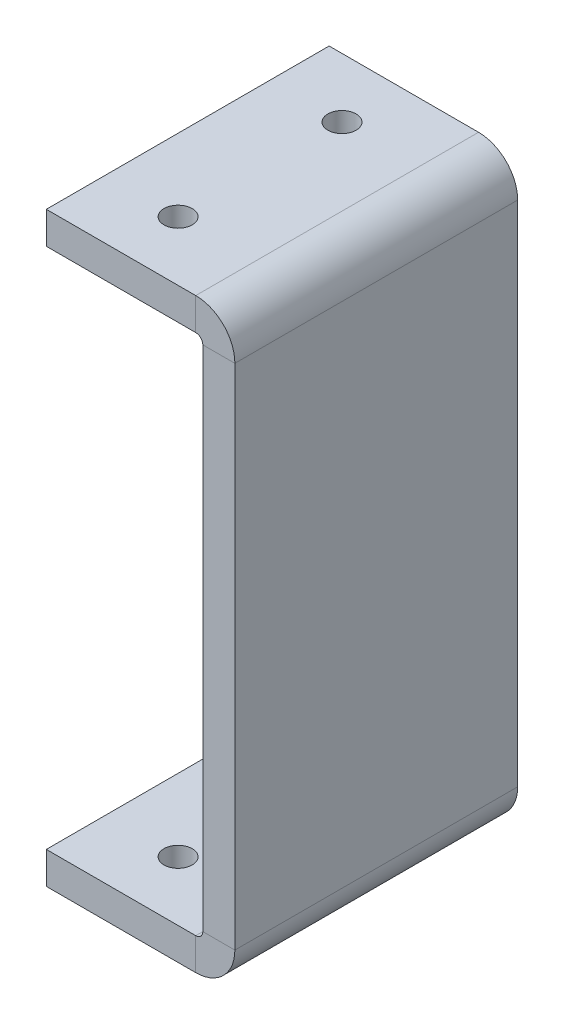
ISO-10303-21;
HEADER;
FILE_DESCRIPTION(('STEP AP214'),'2;1');
FILE_NAME('part.step','',(''),(''),'','','');
FILE_SCHEMA(('AUTOMOTIVE_DESIGN { 1 0 10303 214 1 1 1 1 }'));
ENDSEC;
DATA;
#1=APPLICATION_CONTEXT('core data for automotive mechanical design processes');
#2=APPLICATION_PROTOCOL_DEFINITION('international standard','automotive_design',2000,#1);
#3=PRODUCT_CONTEXT('',#1,'mechanical');
#4=PRODUCT('Part','Part','',(#3));
#5=PRODUCT_RELATED_PRODUCT_CATEGORY('part','',(#4));
#6=PRODUCT_DEFINITION_FORMATION('','',#4);
#7=PRODUCT_DEFINITION_CONTEXT('part definition',#1,'design');
#8=PRODUCT_DEFINITION('design','',#6,#7);
#9=PRODUCT_DEFINITION_SHAPE('','',#8);
#10=(LENGTH_UNIT() NAMED_UNIT(*) SI_UNIT(.MILLI.,.METRE.));
#11=(NAMED_UNIT(*) PLANE_ANGLE_UNIT() SI_UNIT($,.RADIAN.));
#12=(NAMED_UNIT(*) SI_UNIT($,.STERADIAN.) SOLID_ANGLE_UNIT());
#13=UNCERTAINTY_MEASURE_WITH_UNIT(LENGTH_MEASURE(1.E-05),#10,'distance_accuracy_value','');
#14=(GEOMETRIC_REPRESENTATION_CONTEXT(3) GLOBAL_UNCERTAINTY_ASSIGNED_CONTEXT((#13)) GLOBAL_UNIT_ASSIGNED_CONTEXT((#10,
#11,#12)) REPRESENTATION_CONTEXT('',''));
#15=CARTESIAN_POINT('',(0.,0.,0.));
#16=DIRECTION('',(0.,0.,1.));
#17=DIRECTION('',(1.,0.,0.));
#18=AXIS2_PLACEMENT_3D('',#15,#16,#17);
#19=CARTESIAN_POINT('',(1.093708560151E-13,31.1,0.));
#20=DIRECTION('',(0.,-1.,0.));
#21=DIRECTION('',(1.,0.,0.));
#22=AXIS2_PLACEMENT_3D('',#19,#20,#21);
#23=PLANE('',#22);
#24=DIRECTION('',(0.,0.,-1.));
#25=VECTOR('',#24,1.);
#26=CARTESIAN_POINT('',(-4.15,31.1,30.));
#27=LINE('',#26,#25);
#28=CARTESIAN_POINT('',(-4.15,31.1,0.));
#29=VERTEX_POINT('',#28);
#30=CARTESIAN_POINT('',(-4.15,31.1,30.));
#31=VERTEX_POINT('',#30);
#32=EDGE_CURVE('E265',#29,#31,#27,.F.);
#33=ORIENTED_EDGE('',*,*,#32,.F.);
#34=DIRECTION('',(-1.,0.,0.));
#35=VECTOR('',#34,1.);
#36=CARTESIAN_POINT('',(1.093708560151E-13,31.1,0.));
#37=LINE('',#36,#35);
#38=CARTESIAN_POINT('',(-20.,31.1000000000001,0.));
#39=VERTEX_POINT('',#38);
#40=EDGE_CURVE('E253',#29,#39,#37,.T.);
#41=ORIENTED_EDGE('',*,*,#40,.T.);
#42=DIRECTION('',(0.,0.,1.));
#43=VECTOR('',#42,1.);
#44=CARTESIAN_POINT('',(-20.,31.1000000000001,0.));
#45=LINE('',#44,#43);
#46=CARTESIAN_POINT('',(-20.,31.1000000000001,30.));
#47=VERTEX_POINT('',#46);
#48=EDGE_CURVE('E251',#39,#47,#45,.T.);
#49=ORIENTED_EDGE('',*,*,#48,.T.);
#50=DIRECTION('',(1.,0.,0.));
#51=VECTOR('',#50,1.);
#52=CARTESIAN_POINT('',(1.093708560151E-13,31.1,30.));
#53=LINE('',#52,#51);
#54=EDGE_CURVE('E255',#47,#31,#53,.T.);
#55=ORIENTED_EDGE('',*,*,#54,.T.);
#56=EDGE_LOOP('',(#33,#41,#49,#55));
#57=FACE_BOUND('',#56,.T.);
#58=CARTESIAN_POINT('',(-12.3293714059226,31.1,6.30666756339837));
#59=DIRECTION('',(0.,1.,0.));
#60=DIRECTION('',(-1.,0.,0.));
#61=AXIS2_PLACEMENT_3D('',#58,#59,#60);
#62=CIRCLE('',#61,1.5);
#63=CARTESIAN_POINT('',(-13.8293714059226,31.1,6.30666756339837));
#64=VERTEX_POINT('',#63);
#65=EDGE_CURVE('E319',#64,#64,#62,.F.);
#66=ORIENTED_EDGE('',*,*,#65,.T.);
#67=EDGE_LOOP('',(#66));
#68=FACE_BOUND('',#67,.T.);
#69=CARTESIAN_POINT('',(-12.3293714059226,31.1,23.6933324366016));
#70=DIRECTION('',(0.,1.,0.));
#71=DIRECTION('',(-1.,0.,0.));
#72=AXIS2_PLACEMENT_3D('',#69,#70,#71);
#73=CIRCLE('',#72,1.49999999999998);
#74=CARTESIAN_POINT('',(-13.8293714059226,31.1,23.6933324366016));
#75=VERTEX_POINT('',#74);
#76=EDGE_CURVE('E309',#75,#75,#73,.T.);
#77=ORIENTED_EDGE('',*,*,#76,.F.);
#78=EDGE_LOOP('',(#77));
#79=FACE_BOUND('',#78,.T.);
#80=ADVANCED_FACE('F88',(#57,#68,#79),#23,.F.);
#81=CARTESIAN_POINT('',(0.,27.7,0.));
#82=DIRECTION('',(0.,-1.,0.));
#83=DIRECTION('',(1.,0.,0.));
#84=AXIS2_PLACEMENT_3D('',#81,#82,#83);
#85=PLANE('',#84);
#86=CARTESIAN_POINT('',(-12.3293714059226,27.7,6.30666756339837));
#87=DIRECTION('',(0.,-1.,0.));
#88=DIRECTION('',(1.,0.,0.));
#89=AXIS2_PLACEMENT_3D('',#86,#87,#88);
#90=CIRCLE('',#89,1.5);
#91=CARTESIAN_POINT('',(-10.8293714059226,27.7,6.30666756339837));
#92=VERTEX_POINT('',#91);
#93=EDGE_CURVE('E302',#92,#92,#90,.F.);
#94=ORIENTED_EDGE('',*,*,#93,.T.);
#95=EDGE_LOOP('',(#94));
#96=FACE_BOUND('',#95,.T.);
#97=DIRECTION('',(1.,0.,0.));
#98=VECTOR('',#97,1.);
#99=CARTESIAN_POINT('',(-20.,27.7000000000001,0.));
#100=LINE('',#99,#98);
#101=CARTESIAN_POINT('',(-4.15000000000001,27.7,0.));
#102=VERTEX_POINT('',#101);
#103=CARTESIAN_POINT('',(-20.,27.7000000000001,0.));
#104=VERTEX_POINT('',#103);
#105=EDGE_CURVE('E260',#102,#104,#100,.F.);
#106=ORIENTED_EDGE('',*,*,#105,.F.);
#107=DIRECTION('',(0.,0.,-1.));
#108=VECTOR('',#107,1.);
#109=CARTESIAN_POINT('',(-4.15000000000001,27.7,30.));
#110=LINE('',#109,#108);
#111=CARTESIAN_POINT('',(-4.15000000000001,27.7,30.));
#112=VERTEX_POINT('',#111);
#113=EDGE_CURVE('E270',#112,#102,#110,.T.);
#114=ORIENTED_EDGE('',*,*,#113,.F.);
#115=DIRECTION('',(-1.,0.,0.));
#116=VECTOR('',#115,1.);
#117=CARTESIAN_POINT('',(-3.40000000000001,27.7,30.));
#118=LINE('',#117,#116);
#119=CARTESIAN_POINT('',(-20.,27.7000000000001,30.));
#120=VERTEX_POINT('',#119);
#121=EDGE_CURVE('E262',#120,#112,#118,.F.);
#122=ORIENTED_EDGE('',*,*,#121,.F.);
#123=DIRECTION('',(0.,0.,-1.));
#124=VECTOR('',#123,1.);
#125=CARTESIAN_POINT('',(-20.,27.7000000000001,30.));
#126=LINE('',#125,#124);
#127=EDGE_CURVE('E258',#104,#120,#126,.F.);
#128=ORIENTED_EDGE('',*,*,#127,.F.);
#129=EDGE_LOOP('',(#106,#114,#122,#128));
#130=FACE_BOUND('',#129,.T.);
#131=CARTESIAN_POINT('',(-12.3293714059226,27.7,23.6933324366016));
#132=DIRECTION('',(0.,-1.,0.));
#133=DIRECTION('',(1.,0.,0.));
#134=AXIS2_PLACEMENT_3D('',#131,#132,#133);
#135=CIRCLE('',#134,1.49999999999998);
#136=CARTESIAN_POINT('',(-10.8293714059227,27.7,23.6933324366016));
#137=VERTEX_POINT('',#136);
#138=EDGE_CURVE('E222',#137,#137,#135,.T.);
#139=ORIENTED_EDGE('',*,*,#138,.F.);
#140=EDGE_LOOP('',(#139));
#141=FACE_BOUND('',#140,.T.);
#142=ADVANCED_FACE('F379',(#96,#130,#141),#85,.T.);
#143=CARTESIAN_POINT('',(1.28870819907707E-13,-31.1,0.));
#144=DIRECTION('',(0.,1.,0.));
#145=DIRECTION('',(-1.,0.,0.));
#146=AXIS2_PLACEMENT_3D('',#143,#144,#145);
#147=PLANE('',#146);
#148=DIRECTION('',(0.,0.,1.));
#149=VECTOR('',#148,1.);
#150=CARTESIAN_POINT('',(-4.14999999999997,-31.1,0.));
#151=LINE('',#150,#149);
#152=CARTESIAN_POINT('',(-4.14999999999997,-31.1,30.));
#153=VERTEX_POINT('',#152);
#154=CARTESIAN_POINT('',(-4.14999999999997,-31.1,0.));
#155=VERTEX_POINT('',#154);
#156=EDGE_CURVE('E214',#153,#155,#151,.F.);
#157=ORIENTED_EDGE('',*,*,#156,.F.);
#158=DIRECTION('',(-1.,0.,0.));
#159=VECTOR('',#158,1.);
#160=CARTESIAN_POINT('',(1.28870819907707E-13,-31.1,30.));
#161=LINE('',#160,#159);
#162=CARTESIAN_POINT('',(-20.,-31.1000000000001,30.));
#163=VERTEX_POINT('',#162);
#164=EDGE_CURVE('E187',#153,#163,#161,.T.);
#165=ORIENTED_EDGE('',*,*,#164,.T.);
#166=DIRECTION('',(0.,0.,-1.));
#167=VECTOR('',#166,1.);
#168=CARTESIAN_POINT('',(-20.,-31.1000000000001,0.));
#169=LINE('',#168,#167);
#170=CARTESIAN_POINT('',(-20.,-31.1000000000001,0.));
#171=VERTEX_POINT('',#170);
#172=EDGE_CURVE('E179',#163,#171,#169,.T.);
#173=ORIENTED_EDGE('',*,*,#172,.T.);
#174=DIRECTION('',(1.,0.,0.));
#175=VECTOR('',#174,1.);
#176=CARTESIAN_POINT('',(1.28870819907707E-13,-31.1,0.));
#177=LINE('',#176,#175);
#178=EDGE_CURVE('E185',#171,#155,#177,.T.);
#179=ORIENTED_EDGE('',*,*,#178,.T.);
#180=EDGE_LOOP('',(#157,#165,#173,#179));
#181=FACE_BOUND('',#180,.T.);
#182=CARTESIAN_POINT('',(-12.3293714059228,-31.1000000000001,6.30666756339837));
#183=DIRECTION('',(0.,1.,0.));
#184=DIRECTION('',(-1.,0.,0.));
#185=AXIS2_PLACEMENT_3D('',#182,#183,#184);
#186=CIRCLE('',#185,1.5);
#187=CARTESIAN_POINT('',(-13.8293714059228,-31.1000000000001,6.30666756339837));
#188=VERTEX_POINT('',#187);
#189=EDGE_CURVE('E314',#188,#188,#186,.F.);
#190=ORIENTED_EDGE('',*,*,#189,.F.);
#191=EDGE_LOOP('',(#190));
#192=FACE_BOUND('',#191,.T.);
#193=CARTESIAN_POINT('',(-12.3293714059228,-31.1000000000001,23.6933324366016));
#194=DIRECTION('',(0.,1.,0.));
#195=DIRECTION('',(-1.,0.,0.));
#196=AXIS2_PLACEMENT_3D('',#193,#194,#195);
#197=CIRCLE('',#196,1.49999999999998);
#198=CARTESIAN_POINT('',(-13.8293714059228,-31.1000000000001,23.6933324366016));
#199=VERTEX_POINT('',#198);
#200=EDGE_CURVE('E303',#199,#199,#197,.T.);
#201=ORIENTED_EDGE('',*,*,#200,.T.);
#202=EDGE_LOOP('',(#201));
#203=FACE_BOUND('',#202,.T.);
#204=ADVANCED_FACE('F182',(#181,#192,#203),#147,.F.);
#205=CARTESIAN_POINT('',(1.15958833576365E-13,-27.7,0.));
#206=DIRECTION('',(0.,1.,0.));
#207=DIRECTION('',(-1.,0.,0.));
#208=AXIS2_PLACEMENT_3D('',#205,#206,#207);
#209=PLANE('',#208);
#210=CARTESIAN_POINT('',(-12.3293714059228,-27.7,6.30666756339837));
#211=DIRECTION('',(0.,1.,0.));
#212=DIRECTION('',(-1.,0.,0.));
#213=AXIS2_PLACEMENT_3D('',#210,#211,#212);
#214=CIRCLE('',#213,1.5);
#215=CARTESIAN_POINT('',(-13.8293714059228,-27.7,6.30666756339837));
#216=VERTEX_POINT('',#215);
#217=EDGE_CURVE('E300',#216,#216,#214,.F.);
#218=ORIENTED_EDGE('',*,*,#217,.T.);
#219=EDGE_LOOP('',(#218));
#220=FACE_BOUND('',#219,.T.);
#221=DIRECTION('',(1.,0.,0.));
#222=VECTOR('',#221,1.);
#223=CARTESIAN_POINT('',(-20.,-27.7000000000001,30.));
#224=LINE('',#223,#222);
#225=CARTESIAN_POINT('',(-4.14999999999999,-27.7,30.));
#226=VERTEX_POINT('',#225);
#227=CARTESIAN_POINT('',(-20.,-27.7000000000001,30.));
#228=VERTEX_POINT('',#227);
#229=EDGE_CURVE('E212',#226,#228,#224,.F.);
#230=ORIENTED_EDGE('',*,*,#229,.F.);
#231=DIRECTION('',(0.,0.,1.));
#232=VECTOR('',#231,1.);
#233=CARTESIAN_POINT('',(-4.14999999999999,-27.7,0.));
#234=LINE('',#233,#232);
#235=CARTESIAN_POINT('',(-4.14999999999999,-27.7,0.));
#236=VERTEX_POINT('',#235);
#237=EDGE_CURVE('E219',#236,#226,#234,.T.);
#238=ORIENTED_EDGE('',*,*,#237,.F.);
#239=DIRECTION('',(-1.,0.,0.));
#240=VECTOR('',#239,1.);
#241=CARTESIAN_POINT('',(-3.39999999999999,-27.7,0.));
#242=LINE('',#241,#240);
#243=CARTESIAN_POINT('',(-20.,-27.7000000000001,0.));
#244=VERTEX_POINT('',#243);
#245=EDGE_CURVE('E209',#244,#236,#242,.F.);
#246=ORIENTED_EDGE('',*,*,#245,.F.);
#247=DIRECTION('',(0.,0.,1.));
#248=VECTOR('',#247,1.);
#249=CARTESIAN_POINT('',(-20.,-27.7000000000001,0.));
#250=LINE('',#249,#248);
#251=EDGE_CURVE('E196',#228,#244,#250,.F.);
#252=ORIENTED_EDGE('',*,*,#251,.F.);
#253=EDGE_LOOP('',(#230,#238,#246,#252));
#254=FACE_BOUND('',#253,.T.);
#255=CARTESIAN_POINT('',(-12.3293714059228,-27.7,23.6933324366016));
#256=DIRECTION('',(0.,1.,0.));
#257=DIRECTION('',(-1.,0.,0.));
#258=AXIS2_PLACEMENT_3D('',#255,#256,#257);
#259=CIRCLE('',#258,1.49999999999998);
#260=CARTESIAN_POINT('',(-13.8293714059228,-27.7,23.6933324366016));
#261=VERTEX_POINT('',#260);
#262=EDGE_CURVE('E92',#261,#261,#259,.T.);
#263=ORIENTED_EDGE('',*,*,#262,.F.);
#264=EDGE_LOOP('',(#263));
#265=FACE_BOUND('',#264,.T.);
#266=ADVANCED_FACE('F329',(#220,#254,#265),#209,.T.);
#267=CARTESIAN_POINT('',(-3.40000000000001,31.1,30.));
#268=DIRECTION('',(1.,0.,0.));
#269=DIRECTION('',(0.,1.,0.));
#270=AXIS2_PLACEMENT_3D('',#267,#268,#269);
#271=PLANE('',#270);
#272=DIRECTION('',(0.,0.,1.));
#273=VECTOR('',#272,1.);
#274=CARTESIAN_POINT('',(-3.39999999999999,-26.95,30.));
#275=LINE('',#274,#273);
#276=CARTESIAN_POINT('',(-3.39999999999999,-26.95,30.));
#277=VERTEX_POINT('',#276);
#278=CARTESIAN_POINT('',(-3.39999999999999,-26.95,0.));
#279=VERTEX_POINT('',#278);
#280=EDGE_CURVE('E234',#277,#279,#275,.F.);
#281=ORIENTED_EDGE('',*,*,#280,.F.);
#282=DIRECTION('',(0.,-1.,0.));
#283=VECTOR('',#282,1.);
#284=CARTESIAN_POINT('',(-3.40000000000001,31.1,30.));
#285=LINE('',#284,#283);
#286=CARTESIAN_POINT('',(-3.40000000000001,26.95,30.));
#287=VERTEX_POINT('',#286);
#288=EDGE_CURVE('E97',#287,#277,#285,.T.);
#289=ORIENTED_EDGE('',*,*,#288,.F.);
#290=DIRECTION('',(0.,0.,-1.));
#291=VECTOR('',#290,1.);
#292=CARTESIAN_POINT('',(-3.40000000000001,26.95,0.));
#293=LINE('',#292,#291);
#294=CARTESIAN_POINT('',(-3.40000000000001,26.95,0.));
#295=VERTEX_POINT('',#294);
#296=EDGE_CURVE('E285',#295,#287,#293,.F.);
#297=ORIENTED_EDGE('',*,*,#296,.F.);
#298=DIRECTION('',(0.,-1.,0.));
#299=VECTOR('',#298,1.);
#300=CARTESIAN_POINT('',(-3.40000000000001,31.1,0.));
#301=LINE('',#300,#299);
#302=EDGE_CURVE('E291',#295,#279,#301,.T.);
#303=ORIENTED_EDGE('',*,*,#302,.T.);
#304=EDGE_LOOP('',(#281,#289,#297,#303));
#305=FACE_BOUND('',#304,.T.);
#306=ADVANCED_FACE('F90',(#305),#271,.F.);
#307=CARTESIAN_POINT('',(0.,31.1,30.));
#308=DIRECTION('',(1.,0.,0.));
#309=DIRECTION('',(0.,1.,0.));
#310=AXIS2_PLACEMENT_3D('',#307,#308,#309);
#311=PLANE('',#310);
#312=DIRECTION('',(0.,-1.,0.));
#313=VECTOR('',#312,1.);
#314=CARTESIAN_POINT('',(0.,31.1,30.));
#315=LINE('',#314,#313);
#316=CARTESIAN_POINT('',(0.,26.95,30.));
#317=VERTEX_POINT('',#316);
#318=CARTESIAN_POINT('',(0.,-26.95,30.));
#319=VERTEX_POINT('',#318);
#320=EDGE_CURVE('E15',#317,#319,#315,.T.);
#321=ORIENTED_EDGE('',*,*,#320,.T.);
#322=DIRECTION('',(0.,0.,1.));
#323=VECTOR('',#322,1.);
#324=CARTESIAN_POINT('',(0.,-26.95,30.));
#325=LINE('',#324,#323);
#326=CARTESIAN_POINT('',(0.,-26.95,0.));
#327=VERTEX_POINT('',#326);
#328=EDGE_CURVE('E223',#319,#327,#325,.F.);
#329=ORIENTED_EDGE('',*,*,#328,.T.);
#330=DIRECTION('',(0.,-1.,0.));
#331=VECTOR('',#330,1.);
#332=CARTESIAN_POINT('',(0.,31.1,0.));
#333=LINE('',#332,#331);
#334=CARTESIAN_POINT('',(0.,26.95,0.));
#335=VERTEX_POINT('',#334);
#336=EDGE_CURVE('E295',#335,#327,#333,.T.);
#337=ORIENTED_EDGE('',*,*,#336,.F.);
#338=DIRECTION('',(0.,0.,-1.));
#339=VECTOR('',#338,1.);
#340=CARTESIAN_POINT('',(0.,26.95,0.));
#341=LINE('',#340,#339);
#342=EDGE_CURVE('E274',#335,#317,#341,.F.);
#343=ORIENTED_EDGE('',*,*,#342,.T.);
#344=EDGE_LOOP('',(#321,#329,#337,#343));
#345=FACE_BOUND('',#344,.T.);
#346=ADVANCED_FACE('F344',(#345),#311,.T.);
#347=CARTESIAN_POINT('',(0.,0.,30.));
#348=DIRECTION('',(0.,0.,-1.));
#349=DIRECTION('',(-1.,0.,0.));
#350=AXIS2_PLACEMENT_3D('',#347,#348,#349);
#351=PLANE('',#350);
#352=DIRECTION('',(1.,0.,0.));
#353=VECTOR('',#352,1.);
#354=CARTESIAN_POINT('',(-3.39999999999999,-26.95,30.));
#355=LINE('',#354,#353);
#356=EDGE_CURVE('E228',#277,#319,#355,.T.);
#357=ORIENTED_EDGE('',*,*,#356,.T.);
#358=ORIENTED_EDGE('',*,*,#320,.F.);
#359=DIRECTION('',(1.,0.,0.));
#360=VECTOR('',#359,1.);
#361=CARTESIAN_POINT('',(-3.40000000000001,26.95,30.));
#362=LINE('',#361,#360);
#363=EDGE_CURVE('E289',#287,#317,#362,.T.);
#364=ORIENTED_EDGE('',*,*,#363,.F.);
#365=ORIENTED_EDGE('',*,*,#288,.T.);
#366=EDGE_LOOP('',(#357,#358,#364,#365));
#367=FACE_BOUND('',#366,.T.);
#368=ADVANCED_FACE('F340',(#367),#351,.F.);
#369=CARTESIAN_POINT('',(0.,0.,0.));
#370=DIRECTION('',(0.,0.,-1.));
#371=DIRECTION('',(-1.,0.,0.));
#372=AXIS2_PLACEMENT_3D('',#369,#370,#371);
#373=PLANE('',#372);
#374=DIRECTION('',(1.,0.,0.));
#375=VECTOR('',#374,1.);
#376=CARTESIAN_POINT('',(-3.39999999999999,-26.95,0.));
#377=LINE('',#376,#375);
#378=EDGE_CURVE('E239',#279,#327,#377,.T.);
#379=ORIENTED_EDGE('',*,*,#378,.F.);
#380=ORIENTED_EDGE('',*,*,#302,.F.);
#381=DIRECTION('',(1.,0.,0.));
#382=VECTOR('',#381,1.);
#383=CARTESIAN_POINT('',(-3.40000000000001,26.95,0.));
#384=LINE('',#383,#382);
#385=EDGE_CURVE('E279',#295,#335,#384,.T.);
#386=ORIENTED_EDGE('',*,*,#385,.T.);
#387=ORIENTED_EDGE('',*,*,#336,.T.);
#388=EDGE_LOOP('',(#379,#380,#386,#387));
#389=FACE_BOUND('',#388,.T.);
#390=ADVANCED_FACE('F355',(#389),#373,.T.);
#391=CARTESIAN_POINT('',(-4.15000000000001,26.95,30.));
#392=DIRECTION('',(0.,0.,1.));
#393=DIRECTION('',(1.,0.,0.));
#394=AXIS2_PLACEMENT_3D('',#391,#392,#393);
#395=PLANE('',#394);
#396=DIRECTION('',(0.,-1.,0.));
#397=VECTOR('',#396,1.);
#398=CARTESIAN_POINT('',(-4.15,31.1,30.));
#399=LINE('',#398,#397);
#400=EDGE_CURVE('E241',#112,#31,#399,.F.);
#401=ORIENTED_EDGE('',*,*,#400,.F.);
#402=CARTESIAN_POINT('',(-4.15000000000001,26.95,30.));
#403=DIRECTION('',(0.,0.,-1.));
#404=DIRECTION('',(-1.,0.,0.));
#405=AXIS2_PLACEMENT_3D('',#402,#403,#404);
#406=CIRCLE('',#405,0.750000000000001);
#407=EDGE_CURVE('E282',#287,#112,#406,.F.);
#408=ORIENTED_EDGE('',*,*,#407,.F.);
#409=ORIENTED_EDGE('',*,*,#363,.T.);
#410=CARTESIAN_POINT('',(-4.15000000000001,26.95,30.));
#411=DIRECTION('',(0.,0.,-1.));
#412=DIRECTION('',(-1.,0.,0.));
#413=AXIS2_PLACEMENT_3D('',#410,#411,#412);
#414=CIRCLE('',#413,4.15);
#415=EDGE_CURVE('E105',#317,#31,#414,.F.);
#416=ORIENTED_EDGE('',*,*,#415,.T.);
#417=EDGE_LOOP('',(#401,#408,#409,#416));
#418=FACE_BOUND('',#417,.T.);
#419=ADVANCED_FACE('F363',(#418),#395,.T.);
#420=CARTESIAN_POINT('',(-4.15000000000001,26.95,0.));
#421=DIRECTION('',(0.,0.,1.));
#422=DIRECTION('',(1.,0.,0.));
#423=AXIS2_PLACEMENT_3D('',#420,#421,#422);
#424=PLANE('',#423);
#425=CARTESIAN_POINT('',(-4.15000000000001,26.95,0.));
#426=DIRECTION('',(0.,0.,-1.));
#427=DIRECTION('',(-1.,0.,0.));
#428=AXIS2_PLACEMENT_3D('',#425,#426,#427);
#429=CIRCLE('',#428,0.750000000000001);
#430=EDGE_CURVE('E247',#102,#295,#429,.T.);
#431=ORIENTED_EDGE('',*,*,#430,.F.);
#432=DIRECTION('',(0.,-1.,0.));
#433=VECTOR('',#432,1.);
#434=CARTESIAN_POINT('',(-4.15000000000001,27.7,0.));
#435=LINE('',#434,#433);
#436=EDGE_CURVE('E267',#102,#29,#435,.F.);
#437=ORIENTED_EDGE('',*,*,#436,.T.);
#438=CARTESIAN_POINT('',(-4.15000000000001,26.95,0.));
#439=DIRECTION('',(0.,0.,-1.));
#440=DIRECTION('',(-1.,0.,0.));
#441=AXIS2_PLACEMENT_3D('',#438,#439,#440);
#442=CIRCLE('',#441,4.15);
#443=EDGE_CURVE('E277',#29,#335,#442,.T.);
#444=ORIENTED_EDGE('',*,*,#443,.T.);
#445=ORIENTED_EDGE('',*,*,#385,.F.);
#446=EDGE_LOOP('',(#431,#437,#444,#445));
#447=FACE_BOUND('',#446,.T.);
#448=ADVANCED_FACE('F349',(#447),#424,.F.);
#449=CARTESIAN_POINT('',(-4.15000000000001,26.95,0.));
#450=DIRECTION('',(0.,0.,-1.));
#451=DIRECTION('',(0.,1.,0.));
#452=AXIS2_PLACEMENT_3D('',#449,#450,#451);
#453=CYLINDRICAL_SURFACE('',#452,4.15);
#454=ORIENTED_EDGE('',*,*,#342,.F.);
#455=ORIENTED_EDGE('',*,*,#443,.F.);
#456=ORIENTED_EDGE('',*,*,#32,.T.);
#457=ORIENTED_EDGE('',*,*,#415,.F.);
#458=EDGE_LOOP('',(#454,#455,#456,#457));
#459=FACE_BOUND('',#458,.T.);
#460=ADVANCED_FACE('F346',(#459),#453,.T.);
#461=CARTESIAN_POINT('',(-4.15000000000001,26.95,0.));
#462=DIRECTION('',(0.,0.,-1.));
#463=DIRECTION('',(0.,1.,0.));
#464=AXIS2_PLACEMENT_3D('',#461,#462,#463);
#465=CYLINDRICAL_SURFACE('',#464,0.750000000000001);
#466=ORIENTED_EDGE('',*,*,#296,.T.);
#467=ORIENTED_EDGE('',*,*,#407,.T.);
#468=ORIENTED_EDGE('',*,*,#113,.T.);
#469=ORIENTED_EDGE('',*,*,#430,.T.);
#470=EDGE_LOOP('',(#466,#467,#468,#469));
#471=FACE_BOUND('',#470,.T.);
#472=ADVANCED_FACE('F360',(#471),#465,.F.);
#473=CARTESIAN_POINT('',(-3.4,31.1,30.));
#474=DIRECTION('',(0.,0.,-1.));
#475=DIRECTION('',(-1.,0.,0.));
#476=AXIS2_PLACEMENT_3D('',#473,#474,#475);
#477=PLANE('',#476);
#478=ORIENTED_EDGE('',*,*,#400,.T.);
#479=ORIENTED_EDGE('',*,*,#54,.F.);
#480=DIRECTION('',(0.,-1.,0.));
#481=VECTOR('',#480,1.);
#482=CARTESIAN_POINT('',(-20.,31.1000000000001,30.));
#483=LINE('',#482,#481);
#484=EDGE_CURVE('E248',#47,#120,#483,.T.);
#485=ORIENTED_EDGE('',*,*,#484,.T.);
#486=ORIENTED_EDGE('',*,*,#121,.T.);
#487=EDGE_LOOP('',(#478,#479,#485,#486));
#488=FACE_BOUND('',#487,.T.);
#489=ADVANCED_FACE('F366',(#488),#477,.F.);
#490=CARTESIAN_POINT('',(-20.,31.1000000000001,0.));
#491=DIRECTION('',(0.,0.,1.));
#492=DIRECTION('',(1.,0.,0.));
#493=AXIS2_PLACEMENT_3D('',#490,#491,#492);
#494=PLANE('',#493);
#495=ORIENTED_EDGE('',*,*,#436,.F.);
#496=ORIENTED_EDGE('',*,*,#105,.T.);
#497=DIRECTION('',(0.,-1.,0.));
#498=VECTOR('',#497,1.);
#499=CARTESIAN_POINT('',(-20.,31.1000000000001,0.));
#500=LINE('',#499,#498);
#501=EDGE_CURVE('E244',#39,#104,#500,.T.);
#502=ORIENTED_EDGE('',*,*,#501,.F.);
#503=ORIENTED_EDGE('',*,*,#40,.F.);
#504=EDGE_LOOP('',(#495,#496,#502,#503));
#505=FACE_BOUND('',#504,.T.);
#506=ADVANCED_FACE('F382',(#505),#494,.F.);
#507=CARTESIAN_POINT('',(-20.,31.1000000000001,30.));
#508=DIRECTION('',(1.,0.,0.));
#509=DIRECTION('',(0.,1.,0.));
#510=AXIS2_PLACEMENT_3D('',#507,#508,#509);
#511=PLANE('',#510);
#512=ORIENTED_EDGE('',*,*,#127,.T.);
#513=ORIENTED_EDGE('',*,*,#484,.F.);
#514=ORIENTED_EDGE('',*,*,#48,.F.);
#515=ORIENTED_EDGE('',*,*,#501,.T.);
#516=EDGE_LOOP('',(#512,#513,#514,#515));
#517=FACE_BOUND('',#516,.T.);
#518=ADVANCED_FACE('F375',(#517),#511,.F.);
#519=CARTESIAN_POINT('',(-4.14999999999999,-26.95,0.));
#520=DIRECTION('',(0.,0.,-1.));
#521=DIRECTION('',(-1.,0.,0.));
#522=AXIS2_PLACEMENT_3D('',#519,#520,#521);
#523=PLANE('',#522);
#524=DIRECTION('',(0.,1.,0.));
#525=VECTOR('',#524,1.);
#526=CARTESIAN_POINT('',(-4.14999999999997,-31.1,0.));
#527=LINE('',#526,#525);
#528=EDGE_CURVE('E204',#236,#155,#527,.F.);
#529=ORIENTED_EDGE('',*,*,#528,.F.);
#530=CARTESIAN_POINT('',(-4.14999999999999,-26.95,0.));
#531=DIRECTION('',(0.,0.,1.));
#532=DIRECTION('',(1.,0.,0.));
#533=AXIS2_PLACEMENT_3D('',#530,#531,#532);
#534=CIRCLE('',#533,0.750000000000001);
#535=EDGE_CURVE('E231',#279,#236,#534,.F.);
#536=ORIENTED_EDGE('',*,*,#535,.F.);
#537=ORIENTED_EDGE('',*,*,#378,.T.);
#538=CARTESIAN_POINT('',(-4.14999999999999,-26.95,0.));
#539=DIRECTION('',(0.,0.,1.));
#540=DIRECTION('',(1.,0.,0.));
#541=AXIS2_PLACEMENT_3D('',#538,#539,#540);
#542=CIRCLE('',#541,4.15);
#543=EDGE_CURVE('E113',#327,#155,#542,.F.);
#544=ORIENTED_EDGE('',*,*,#543,.T.);
#545=EDGE_LOOP('',(#529,#536,#537,#544));
#546=FACE_BOUND('',#545,.T.);
#547=ADVANCED_FACE('F389',(#546),#523,.T.);
#548=CARTESIAN_POINT('',(-4.14999999999999,-26.95,30.));
#549=DIRECTION('',(0.,0.,-1.));
#550=DIRECTION('',(-1.,0.,0.));
#551=AXIS2_PLACEMENT_3D('',#548,#549,#550);
#552=PLANE('',#551);
#553=CARTESIAN_POINT('',(-4.14999999999999,-26.95,30.));
#554=DIRECTION('',(0.,0.,1.));
#555=DIRECTION('',(1.,0.,0.));
#556=AXIS2_PLACEMENT_3D('',#553,#554,#555);
#557=CIRCLE('',#556,0.750000000000001);
#558=EDGE_CURVE('E236',#226,#277,#557,.T.);
#559=ORIENTED_EDGE('',*,*,#558,.F.);
#560=DIRECTION('',(0.,1.,0.));
#561=VECTOR('',#560,1.);
#562=CARTESIAN_POINT('',(-4.14999999999999,-27.7,30.));
#563=LINE('',#562,#561);
#564=EDGE_CURVE('E216',#226,#153,#563,.F.);
#565=ORIENTED_EDGE('',*,*,#564,.T.);
#566=CARTESIAN_POINT('',(-4.14999999999999,-26.95,30.));
#567=DIRECTION('',(0.,0.,1.));
#568=DIRECTION('',(1.,0.,0.));
#569=AXIS2_PLACEMENT_3D('',#566,#567,#568);
#570=CIRCLE('',#569,4.15);
#571=EDGE_CURVE('E226',#153,#319,#570,.T.);
#572=ORIENTED_EDGE('',*,*,#571,.T.);
#573=ORIENTED_EDGE('',*,*,#356,.F.);
#574=EDGE_LOOP('',(#559,#565,#572,#573));
#575=FACE_BOUND('',#574,.T.);
#576=ADVANCED_FACE('F337',(#575),#552,.F.);
#577=CARTESIAN_POINT('',(-4.14999999999999,-26.95,30.));
#578=DIRECTION('',(0.,0.,1.));
#579=DIRECTION('',(0.,-1.,0.));
#580=AXIS2_PLACEMENT_3D('',#577,#578,#579);
#581=CYLINDRICAL_SURFACE('',#580,4.15);
#582=ORIENTED_EDGE('',*,*,#328,.F.);
#583=ORIENTED_EDGE('',*,*,#571,.F.);
#584=ORIENTED_EDGE('',*,*,#156,.T.);
#585=ORIENTED_EDGE('',*,*,#543,.F.);
#586=EDGE_LOOP('',(#582,#583,#584,#585));
#587=FACE_BOUND('',#586,.T.);
#588=ADVANCED_FACE('F402',(#587),#581,.T.);
#589=CARTESIAN_POINT('',(-4.14999999999999,-26.95,30.));
#590=DIRECTION('',(0.,0.,1.));
#591=DIRECTION('',(0.,-1.,0.));
#592=AXIS2_PLACEMENT_3D('',#589,#590,#591);
#593=CYLINDRICAL_SURFACE('',#592,0.750000000000001);
#594=ORIENTED_EDGE('',*,*,#280,.T.);
#595=ORIENTED_EDGE('',*,*,#535,.T.);
#596=ORIENTED_EDGE('',*,*,#237,.T.);
#597=ORIENTED_EDGE('',*,*,#558,.T.);
#598=EDGE_LOOP('',(#594,#595,#596,#597));
#599=FACE_BOUND('',#598,.T.);
#600=ADVANCED_FACE('F333',(#599),#593,.F.);
#601=CARTESIAN_POINT('',(-20.,-31.1000000000001,30.));
#602=DIRECTION('',(0.,0.,-1.));
#603=DIRECTION('',(-1.,0.,0.));
#604=AXIS2_PLACEMENT_3D('',#601,#602,#603);
#605=PLANE('',#604);
#606=ORIENTED_EDGE('',*,*,#564,.F.);
#607=ORIENTED_EDGE('',*,*,#229,.T.);
#608=DIRECTION('',(0.,1.,0.));
#609=VECTOR('',#608,1.);
#610=CARTESIAN_POINT('',(-20.,-31.1000000000001,30.));
#611=LINE('',#610,#609);
#612=EDGE_CURVE('E200',#163,#228,#611,.T.);
#613=ORIENTED_EDGE('',*,*,#612,.F.);
#614=ORIENTED_EDGE('',*,*,#164,.F.);
#615=EDGE_LOOP('',(#606,#607,#613,#614));
#616=FACE_BOUND('',#615,.T.);
#617=ADVANCED_FACE('F325',(#616),#605,.F.);
#618=CARTESIAN_POINT('',(-3.39999999999998,-31.1,0.));
#619=DIRECTION('',(0.,0.,1.));
#620=DIRECTION('',(1.,0.,0.));
#621=AXIS2_PLACEMENT_3D('',#618,#619,#620);
#622=PLANE('',#621);
#623=ORIENTED_EDGE('',*,*,#528,.T.);
#624=ORIENTED_EDGE('',*,*,#178,.F.);
#625=DIRECTION('',(0.,1.,0.));
#626=VECTOR('',#625,1.);
#627=CARTESIAN_POINT('',(-20.,-31.1000000000001,0.));
#628=LINE('',#627,#626);
#629=EDGE_CURVE('E193',#171,#244,#628,.T.);
#630=ORIENTED_EDGE('',*,*,#629,.T.);
#631=ORIENTED_EDGE('',*,*,#245,.T.);
#632=EDGE_LOOP('',(#623,#624,#630,#631));
#633=FACE_BOUND('',#632,.T.);
#634=ADVANCED_FACE('F203',(#633),#622,.F.);
#635=CARTESIAN_POINT('',(-20.,-31.1000000000001,0.));
#636=DIRECTION('',(1.,0.,0.));
#637=DIRECTION('',(0.,1.,0.));
#638=AXIS2_PLACEMENT_3D('',#635,#636,#637);
#639=PLANE('',#638);
#640=ORIENTED_EDGE('',*,*,#251,.T.);
#641=ORIENTED_EDGE('',*,*,#629,.F.);
#642=ORIENTED_EDGE('',*,*,#172,.F.);
#643=ORIENTED_EDGE('',*,*,#612,.T.);
#644=EDGE_LOOP('',(#640,#641,#642,#643));
#645=FACE_BOUND('',#644,.T.);
#646=ADVANCED_FACE('F194',(#645),#639,.F.);
#647=CARTESIAN_POINT('',(-12.3293714059228,-31.1000000000001,6.30666756339837));
#648=DIRECTION('',(0.,1.,0.));
#649=DIRECTION('',(-1.,0.,0.));
#650=AXIS2_PLACEMENT_3D('',#647,#648,#649);
#651=CYLINDRICAL_SURFACE('',#650,1.5);
#652=ORIENTED_EDGE('',*,*,#217,.F.);
#653=EDGE_LOOP('',(#652));
#654=FACE_BOUND('',#653,.T.);
#655=ORIENTED_EDGE('',*,*,#189,.T.);
#656=EDGE_LOOP('',(#655));
#657=FACE_BOUND('',#656,.T.);
#658=ADVANCED_FACE('F414',(#654,#657),#651,.F.);
#659=CARTESIAN_POINT('',(-12.3293714059228,-31.1000000000001,23.6933324366016));
#660=DIRECTION('',(0.,1.,0.));
#661=DIRECTION('',(-1.,0.,0.));
#662=AXIS2_PLACEMENT_3D('',#659,#660,#661);
#663=CYLINDRICAL_SURFACE('',#662,1.49999999999998);
#664=ORIENTED_EDGE('',*,*,#262,.T.);
#665=EDGE_LOOP('',(#664));
#666=FACE_BOUND('',#665,.T.);
#667=ORIENTED_EDGE('',*,*,#200,.F.);
#668=EDGE_LOOP('',(#667));
#669=FACE_BOUND('',#668,.T.);
#670=ADVANCED_FACE('F423',(#666,#669),#663,.F.);
#671=ORIENTED_EDGE('',*,*,#93,.F.);
#672=EDGE_LOOP('',(#671));
#673=FACE_BOUND('',#672,.T.);
#674=ORIENTED_EDGE('',*,*,#65,.F.);
#675=EDGE_LOOP('',(#674));
#676=FACE_BOUND('',#675,.T.);
#677=ADVANCED_FACE('F425',(#673,#676),#651,.F.);
#678=ORIENTED_EDGE('',*,*,#138,.T.);
#679=EDGE_LOOP('',(#678));
#680=FACE_BOUND('',#679,.T.);
#681=ORIENTED_EDGE('',*,*,#76,.T.);
#682=EDGE_LOOP('',(#681));
#683=FACE_BOUND('',#682,.T.);
#684=ADVANCED_FACE('F428',(#680,#683),#663,.F.);
#685=CLOSED_SHELL('',(#80,#142,#204,#266,#306,#346,#368,#390,#419,#448,#460,#472,#489,#506,#518,
#547,#576,#588,#600,#617,#634,#646,#658,#670,#677,#684));
#686=MANIFOLD_SOLID_BREP('B2',#685);
#687=ADVANCED_BREP_SHAPE_REPRESENTATION('',(#18,#686),#14);
#688=SHAPE_DEFINITION_REPRESENTATION(#9,#687);
ENDSEC;
END-ISO-10303-21;
